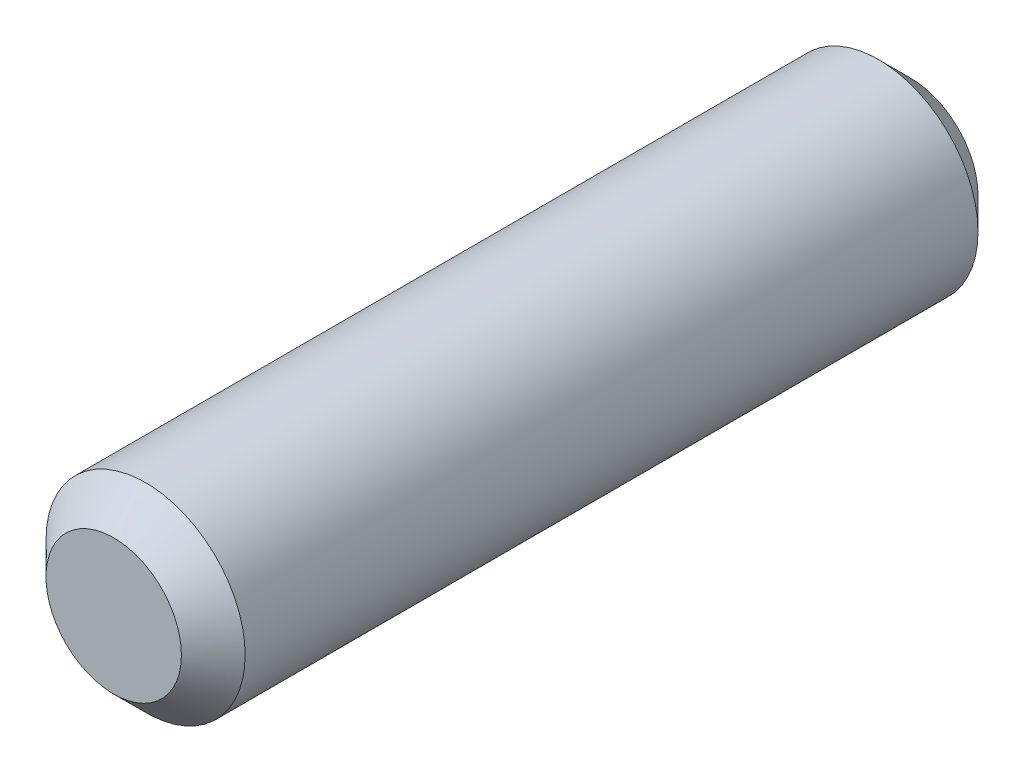
ISO-10303-21;
HEADER;
FILE_DESCRIPTION(('STEP AP214'),'2;1');
FILE_NAME('part.step','',(''),(''),'','','');
FILE_SCHEMA(('AUTOMOTIVE_DESIGN { 1 0 10303 214 1 1 1 1 }'));
ENDSEC;
DATA;
#1=APPLICATION_CONTEXT('core data for automotive mechanical design processes');
#2=APPLICATION_PROTOCOL_DEFINITION('international standard','automotive_design',2000,#1);
#3=PRODUCT_CONTEXT('',#1,'mechanical');
#4=PRODUCT('Part','Part','',(#3));
#5=PRODUCT_RELATED_PRODUCT_CATEGORY('part','',(#4));
#6=PRODUCT_DEFINITION_FORMATION('','',#4);
#7=PRODUCT_DEFINITION_CONTEXT('part definition',#1,'design');
#8=PRODUCT_DEFINITION('design','',#6,#7);
#9=PRODUCT_DEFINITION_SHAPE('','',#8);
#10=(LENGTH_UNIT() NAMED_UNIT(*) SI_UNIT(.MILLI.,.METRE.));
#11=(NAMED_UNIT(*) PLANE_ANGLE_UNIT() SI_UNIT($,.RADIAN.));
#12=(NAMED_UNIT(*) SI_UNIT($,.STERADIAN.) SOLID_ANGLE_UNIT());
#13=UNCERTAINTY_MEASURE_WITH_UNIT(LENGTH_MEASURE(1.E-05),#10,'distance_accuracy_value','');
#14=(GEOMETRIC_REPRESENTATION_CONTEXT(3) GLOBAL_UNCERTAINTY_ASSIGNED_CONTEXT((#13)) GLOBAL_UNIT_ASSIGNED_CONTEXT((#10,
#11,#12)) REPRESENTATION_CONTEXT('',''));
#15=CARTESIAN_POINT('',(0.,0.,0.));
#16=DIRECTION('',(0.,0.,1.));
#17=DIRECTION('',(1.,0.,0.));
#18=AXIS2_PLACEMENT_3D('',#15,#16,#17);
#19=CARTESIAN_POINT('',(0.,0.,12.7));
#20=DIRECTION('',(0.,0.,-1.));
#21=DIRECTION('',(-1.,0.,0.));
#22=AXIS2_PLACEMENT_3D('',#19,#20,#21);
#23=CYLINDRICAL_SURFACE('',#22,1.5875);
#24=CARTESIAN_POINT('',(0.,0.,0.508000000000002));
#25=DIRECTION('',(0.,0.,1.));
#26=DIRECTION('',(1.,0.,0.));
#27=AXIS2_PLACEMENT_3D('',#24,#25,#26);
#28=CIRCLE('',#27,1.5875);
#29=CARTESIAN_POINT('',(1.5875,0.,0.508000000000002));
#30=VERTEX_POINT('',#29);
#31=EDGE_CURVE('E48',#30,#30,#28,.T.);
#32=ORIENTED_EDGE('',*,*,#31,.T.);
#33=EDGE_LOOP('',(#32));
#34=FACE_BOUND('',#33,.T.);
#35=CARTESIAN_POINT('',(0.,0.,12.192));
#36=DIRECTION('',(0.,0.,1.));
#37=DIRECTION('',(1.,0.,0.));
#38=AXIS2_PLACEMENT_3D('',#35,#36,#37);
#39=CIRCLE('',#38,1.5875);
#40=CARTESIAN_POINT('',(1.5875,0.,12.192));
#41=VERTEX_POINT('',#40);
#42=EDGE_CURVE('E52',#41,#41,#39,.F.);
#43=ORIENTED_EDGE('',*,*,#42,.T.);
#44=EDGE_LOOP('',(#43));
#45=FACE_BOUND('',#44,.T.);
#46=ADVANCED_FACE('F36',(#34,#45),#23,.T.);
#47=CARTESIAN_POINT('',(0.,0.,12.7));
#48=DIRECTION('',(0.,0.,1.));
#49=DIRECTION('',(1.,0.,0.));
#50=AXIS2_PLACEMENT_3D('',#47,#48,#49);
#51=PLANE('',#50);
#52=CARTESIAN_POINT('',(0.,0.,12.7));
#53=DIRECTION('',(0.,0.,1.));
#54=DIRECTION('',(1.,0.,0.));
#55=AXIS2_PLACEMENT_3D('',#52,#53,#54);
#56=CIRCLE('',#55,1.0795);
#57=CARTESIAN_POINT('',(1.0795,0.,12.7));
#58=VERTEX_POINT('',#57);
#59=EDGE_CURVE('E10',#58,#58,#56,.T.);
#60=ORIENTED_EDGE('',*,*,#59,.T.);
#61=EDGE_LOOP('',(#60));
#62=FACE_BOUND('',#61,.T.);
#63=ADVANCED_FACE('F68',(#62),#51,.T.);
#64=CARTESIAN_POINT('',(0.,0.,0.));
#65=DIRECTION('',(0.,0.,1.));
#66=DIRECTION('',(1.,0.,0.));
#67=AXIS2_PLACEMENT_3D('',#64,#65,#66);
#68=PLANE('',#67);
#69=CARTESIAN_POINT('',(0.,0.,0.));
#70=DIRECTION('',(0.,0.,1.));
#71=DIRECTION('',(1.,0.,0.));
#72=AXIS2_PLACEMENT_3D('',#69,#70,#71);
#73=CIRCLE('',#72,1.0795);
#74=CARTESIAN_POINT('',(1.0795,0.,0.));
#75=VERTEX_POINT('',#74);
#76=EDGE_CURVE('E44',#75,#75,#73,.F.);
#77=ORIENTED_EDGE('',*,*,#76,.T.);
#78=EDGE_LOOP('',(#77));
#79=FACE_BOUND('',#78,.T.);
#80=ADVANCED_FACE('F65',(#79),#68,.F.);
#81=CARTESIAN_POINT('',(0.,0.,0.508000000000002));
#82=DIRECTION('',(0.,0.,1.));
#83=DIRECTION('',(1.,0.,0.));
#84=AXIS2_PLACEMENT_3D('',#81,#82,#83);
#85=CONICAL_SURFACE('',#84,1.5875,0.785398163397449);
#86=ORIENTED_EDGE('',*,*,#76,.F.);
#87=EDGE_LOOP('',(#86));
#88=FACE_BOUND('',#87,.T.);
#89=ORIENTED_EDGE('',*,*,#31,.F.);
#90=EDGE_LOOP('',(#89));
#91=FACE_BOUND('',#90,.T.);
#92=ADVANCED_FACE('F61',(#88,#91),#85,.T.);
#93=CARTESIAN_POINT('',(0.,0.,12.7));
#94=DIRECTION('',(0.,0.,-1.));
#95=DIRECTION('',(-1.,0.,0.));
#96=AXIS2_PLACEMENT_3D('',#93,#94,#95);
#97=CONICAL_SURFACE('',#96,1.0795,0.785398163397446);
#98=ORIENTED_EDGE('',*,*,#42,.F.);
#99=EDGE_LOOP('',(#98));
#100=FACE_BOUND('',#99,.T.);
#101=ORIENTED_EDGE('',*,*,#59,.F.);
#102=EDGE_LOOP('',(#101));
#103=FACE_BOUND('',#102,.T.);
#104=ADVANCED_FACE('F39',(#100,#103),#97,.T.);
#105=CLOSED_SHELL('',(#46,#63,#80,#92,#104));
#106=MANIFOLD_SOLID_BREP('B2',#105);
#107=ADVANCED_BREP_SHAPE_REPRESENTATION('',(#18,#106),#14);
#108=SHAPE_DEFINITION_REPRESENTATION(#9,#107);
ENDSEC;
END-ISO-10303-21;
